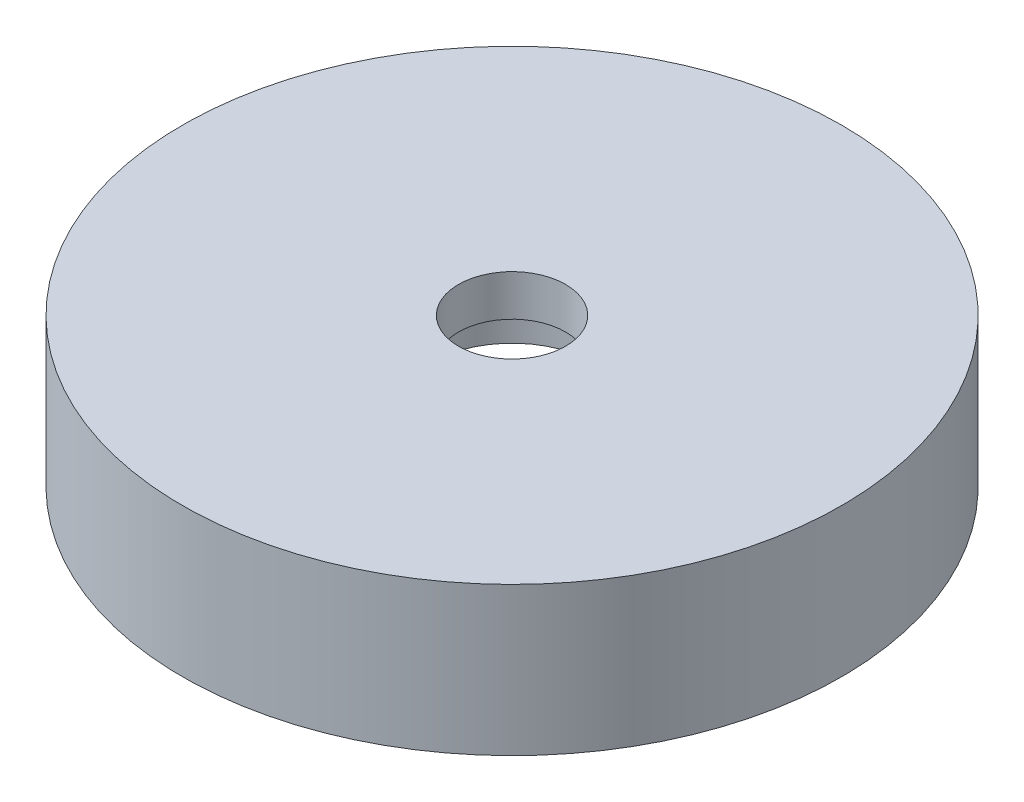
ISO-10303-21;
HEADER;
FILE_DESCRIPTION(('STEP AP214'),'2;1');
FILE_NAME('part.step','',(''),(''),'','','');
FILE_SCHEMA(('AUTOMOTIVE_DESIGN { 1 0 10303 214 1 1 1 1 }'));
ENDSEC;
DATA;
#1=APPLICATION_CONTEXT('core data for automotive mechanical design processes');
#2=APPLICATION_PROTOCOL_DEFINITION('international standard','automotive_design',2000,#1);
#3=PRODUCT_CONTEXT('',#1,'mechanical');
#4=PRODUCT('Part','Part','',(#3));
#5=PRODUCT_RELATED_PRODUCT_CATEGORY('part','',(#4));
#6=PRODUCT_DEFINITION_FORMATION('','',#4);
#7=PRODUCT_DEFINITION_CONTEXT('part definition',#1,'design');
#8=PRODUCT_DEFINITION('design','',#6,#7);
#9=PRODUCT_DEFINITION_SHAPE('','',#8);
#10=(LENGTH_UNIT() NAMED_UNIT(*) SI_UNIT(.MILLI.,.METRE.));
#11=(NAMED_UNIT(*) PLANE_ANGLE_UNIT() SI_UNIT($,.RADIAN.));
#12=(NAMED_UNIT(*) SI_UNIT($,.STERADIAN.) SOLID_ANGLE_UNIT());
#13=UNCERTAINTY_MEASURE_WITH_UNIT(LENGTH_MEASURE(1.E-05),#10,'distance_accuracy_value','');
#14=(GEOMETRIC_REPRESENTATION_CONTEXT(3) GLOBAL_UNCERTAINTY_ASSIGNED_CONTEXT((#13)) GLOBAL_UNIT_ASSIGNED_CONTEXT((#10,
#11,#12)) REPRESENTATION_CONTEXT('',''));
#15=CARTESIAN_POINT('',(0.,0.,0.));
#16=DIRECTION('',(0.,0.,1.));
#17=DIRECTION('',(1.,0.,0.));
#18=AXIS2_PLACEMENT_3D('',#15,#16,#17);
#19=CARTESIAN_POINT('',(20.,14.,0.));
#20=DIRECTION('',(0.,1.,0.));
#21=DIRECTION('',(0.,0.,1.));
#22=AXIS2_PLACEMENT_3D('',#19,#20,#21);
#23=PLANE('',#22);
#24=CARTESIAN_POINT('',(0.,14.,0.));
#25=DIRECTION('',(0.,-1.,0.));
#26=DIRECTION('',(0.,0.,-1.));
#27=AXIS2_PLACEMENT_3D('',#24,#25,#26);
#28=CIRCLE('',#27,3.25);
#29=CARTESIAN_POINT('',(0.,14.,-3.25));
#30=VERTEX_POINT('',#29);
#31=EDGE_CURVE('E10',#30,#30,#28,.T.);
#32=ORIENTED_EDGE('',*,*,#31,.T.);
#33=EDGE_LOOP('',(#32));
#34=FACE_BOUND('',#33,.T.);
#35=CARTESIAN_POINT('',(0.,14.,0.));
#36=DIRECTION('',(0.,-1.,0.));
#37=DIRECTION('',(0.,0.,-1.));
#38=AXIS2_PLACEMENT_3D('',#35,#36,#37);
#39=CIRCLE('',#38,20.);
#40=CARTESIAN_POINT('',(0.,14.,-20.));
#41=VERTEX_POINT('',#40);
#42=EDGE_CURVE('E59',#41,#41,#39,.T.);
#43=ORIENTED_EDGE('',*,*,#42,.F.);
#44=EDGE_LOOP('',(#43));
#45=FACE_BOUND('',#44,.T.);
#46=ADVANCED_FACE('F31',(#34,#45),#23,.T.);
#47=CARTESIAN_POINT('',(0.,0.,0.));
#48=DIRECTION('',(0.,-1.,0.));
#49=DIRECTION('',(0.,0.,-1.));
#50=AXIS2_PLACEMENT_3D('',#47,#48,#49);
#51=CYLINDRICAL_SURFACE('',#50,3.25);
#52=CARTESIAN_POINT('',(0.,11.5,0.));
#53=DIRECTION('',(0.,-1.,0.));
#54=DIRECTION('',(0.,0.,-1.));
#55=AXIS2_PLACEMENT_3D('',#52,#53,#54);
#56=CIRCLE('',#55,3.25);
#57=CARTESIAN_POINT('',(0.,11.5,-3.25));
#58=VERTEX_POINT('',#57);
#59=EDGE_CURVE('E37',#58,#58,#56,.T.);
#60=ORIENTED_EDGE('',*,*,#59,.T.);
#61=EDGE_LOOP('',(#60));
#62=FACE_BOUND('',#61,.T.);
#63=ORIENTED_EDGE('',*,*,#31,.F.);
#64=EDGE_LOOP('',(#63));
#65=FACE_BOUND('',#64,.T.);
#66=ADVANCED_FACE('F67',(#62,#65),#51,.F.);
#67=CARTESIAN_POINT('',(3.25,11.5,0.));
#68=DIRECTION('',(0.,-1.,0.));
#69=DIRECTION('',(0.,0.,-1.));
#70=AXIS2_PLACEMENT_3D('',#67,#68,#69);
#71=PLANE('',#70);
#72=CARTESIAN_POINT('',(0.,11.5,0.));
#73=DIRECTION('',(0.,-1.,0.));
#74=DIRECTION('',(0.,0.,-1.));
#75=AXIS2_PLACEMENT_3D('',#72,#73,#74);
#76=CIRCLE('',#75,5.);
#77=CARTESIAN_POINT('',(0.,11.5,-5.));
#78=VERTEX_POINT('',#77);
#79=EDGE_CURVE('E41',#78,#78,#76,.T.);
#80=ORIENTED_EDGE('',*,*,#79,.T.);
#81=EDGE_LOOP('',(#80));
#82=FACE_BOUND('',#81,.T.);
#83=ORIENTED_EDGE('',*,*,#59,.F.);
#84=EDGE_LOOP('',(#83));
#85=FACE_BOUND('',#84,.T.);
#86=ADVANCED_FACE('F71',(#82,#85),#71,.T.);
#87=CARTESIAN_POINT('',(0.,0.,0.));
#88=DIRECTION('',(0.,-1.,0.));
#89=DIRECTION('',(0.,0.,-1.));
#90=AXIS2_PLACEMENT_3D('',#87,#88,#89);
#91=CYLINDRICAL_SURFACE('',#90,5.);
#92=CARTESIAN_POINT('',(0.,9.,0.));
#93=DIRECTION('',(0.,-1.,0.));
#94=DIRECTION('',(0.,0.,-1.));
#95=AXIS2_PLACEMENT_3D('',#92,#93,#94);
#96=CIRCLE('',#95,5.);
#97=CARTESIAN_POINT('',(0.,9.,-5.));
#98=VERTEX_POINT('',#97);
#99=EDGE_CURVE('E45',#98,#98,#96,.T.);
#100=ORIENTED_EDGE('',*,*,#99,.T.);
#101=EDGE_LOOP('',(#100));
#102=FACE_BOUND('',#101,.T.);
#103=ORIENTED_EDGE('',*,*,#79,.F.);
#104=EDGE_LOOP('',(#103));
#105=FACE_BOUND('',#104,.T.);
#106=ADVANCED_FACE('F75',(#102,#105),#91,.F.);
#107=CARTESIAN_POINT('',(5.,9.,0.));
#108=DIRECTION('',(0.,-1.,0.));
#109=DIRECTION('',(0.,0.,-1.));
#110=AXIS2_PLACEMENT_3D('',#107,#108,#109);
#111=PLANE('',#110);
#112=CARTESIAN_POINT('',(0.,9.,0.));
#113=DIRECTION('',(0.,-1.,0.));
#114=DIRECTION('',(0.,0.,-1.));
#115=AXIS2_PLACEMENT_3D('',#112,#113,#114);
#116=CIRCLE('',#115,17.5);
#117=CARTESIAN_POINT('',(0.,9.,-17.5));
#118=VERTEX_POINT('',#117);
#119=EDGE_CURVE('E50',#118,#118,#116,.T.);
#120=ORIENTED_EDGE('',*,*,#119,.T.);
#121=EDGE_LOOP('',(#120));
#122=FACE_BOUND('',#121,.T.);
#123=ORIENTED_EDGE('',*,*,#99,.F.);
#124=EDGE_LOOP('',(#123));
#125=FACE_BOUND('',#124,.T.);
#126=ADVANCED_FACE('F82',(#122,#125),#111,.T.);
#127=CARTESIAN_POINT('',(0.,0.,0.));
#128=DIRECTION('',(0.,-1.,0.));
#129=DIRECTION('',(0.,0.,-1.));
#130=AXIS2_PLACEMENT_3D('',#127,#128,#129);
#131=CYLINDRICAL_SURFACE('',#130,17.5);
#132=CARTESIAN_POINT('',(0.,5.,0.));
#133=DIRECTION('',(0.,-1.,0.));
#134=DIRECTION('',(0.,0.,-1.));
#135=AXIS2_PLACEMENT_3D('',#132,#133,#134);
#136=CIRCLE('',#135,17.5);
#137=CARTESIAN_POINT('',(0.,5.,-17.5));
#138=VERTEX_POINT('',#137);
#139=EDGE_CURVE('E53',#138,#138,#136,.T.);
#140=ORIENTED_EDGE('',*,*,#139,.T.);
#141=EDGE_LOOP('',(#140));
#142=FACE_BOUND('',#141,.T.);
#143=ORIENTED_EDGE('',*,*,#119,.F.);
#144=EDGE_LOOP('',(#143));
#145=FACE_BOUND('',#144,.T.);
#146=ADVANCED_FACE('F86',(#142,#145),#131,.F.);
#147=CARTESIAN_POINT('',(17.5,5.,0.));
#148=DIRECTION('',(0.,-1.,0.));
#149=DIRECTION('',(0.,0.,-1.));
#150=AXIS2_PLACEMENT_3D('',#147,#148,#149);
#151=PLANE('',#150);
#152=CARTESIAN_POINT('',(0.,5.,0.));
#153=DIRECTION('',(0.,-1.,0.));
#154=DIRECTION('',(0.,0.,-1.));
#155=AXIS2_PLACEMENT_3D('',#152,#153,#154);
#156=CIRCLE('',#155,20.);
#157=CARTESIAN_POINT('',(0.,5.,-20.));
#158=VERTEX_POINT('',#157);
#159=EDGE_CURVE('E56',#158,#158,#156,.T.);
#160=ORIENTED_EDGE('',*,*,#159,.T.);
#161=EDGE_LOOP('',(#160));
#162=FACE_BOUND('',#161,.T.);
#163=ORIENTED_EDGE('',*,*,#139,.F.);
#164=EDGE_LOOP('',(#163));
#165=FACE_BOUND('',#164,.T.);
#166=ADVANCED_FACE('F90',(#162,#165),#151,.T.);
#167=CARTESIAN_POINT('',(0.,0.,0.));
#168=DIRECTION('',(0.,-1.,0.));
#169=DIRECTION('',(0.,0.,-1.));
#170=AXIS2_PLACEMENT_3D('',#167,#168,#169);
#171=CYLINDRICAL_SURFACE('',#170,20.);
#172=ORIENTED_EDGE('',*,*,#42,.T.);
#173=EDGE_LOOP('',(#172));
#174=FACE_BOUND('',#173,.T.);
#175=ORIENTED_EDGE('',*,*,#159,.F.);
#176=EDGE_LOOP('',(#175));
#177=FACE_BOUND('',#176,.T.);
#178=ADVANCED_FACE('F63',(#174,#177),#171,.T.);
#179=CLOSED_SHELL('',(#46,#66,#86,#106,#126,#146,#166,#178));
#180=MANIFOLD_SOLID_BREP('B2',#179);
#181=ADVANCED_BREP_SHAPE_REPRESENTATION('',(#18,#180),#14);
#182=SHAPE_DEFINITION_REPRESENTATION(#9,#181);
ENDSEC;
END-ISO-10303-21;
